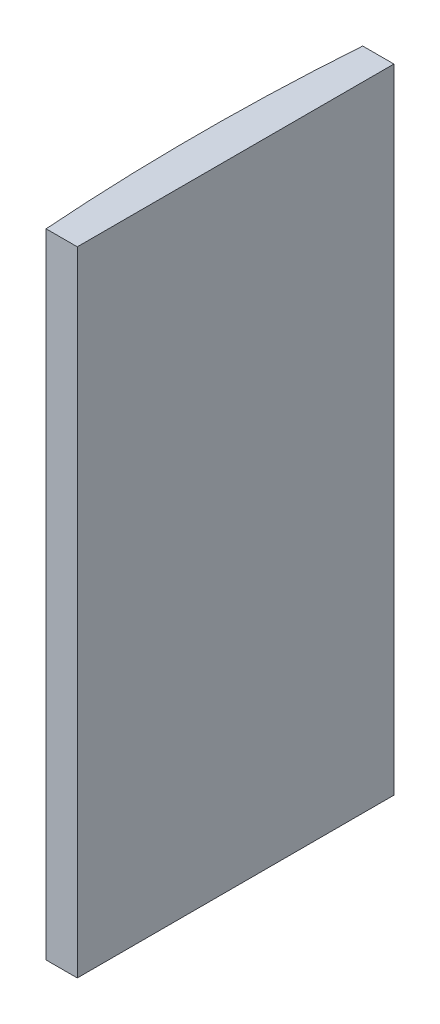
ISO-10303-21;
HEADER;
FILE_DESCRIPTION(('STEP AP214'),'2;1');
FILE_NAME('part.step','',(''),(''),'','','');
FILE_SCHEMA(('AUTOMOTIVE_DESIGN { 1 0 10303 214 1 1 1 1 }'));
ENDSEC;
DATA;
#1=APPLICATION_CONTEXT('core data for automotive mechanical design processes');
#2=APPLICATION_PROTOCOL_DEFINITION('international standard','automotive_design',2000,#1);
#3=PRODUCT_CONTEXT('',#1,'mechanical');
#4=PRODUCT('Part','Part','',(#3));
#5=PRODUCT_RELATED_PRODUCT_CATEGORY('part','',(#4));
#6=PRODUCT_DEFINITION_FORMATION('','',#4);
#7=PRODUCT_DEFINITION_CONTEXT('part definition',#1,'design');
#8=PRODUCT_DEFINITION('design','',#6,#7);
#9=PRODUCT_DEFINITION_SHAPE('','',#8);
#10=(LENGTH_UNIT() NAMED_UNIT(*) SI_UNIT(.MILLI.,.METRE.));
#11=(NAMED_UNIT(*) PLANE_ANGLE_UNIT() SI_UNIT($,.RADIAN.));
#12=(NAMED_UNIT(*) SI_UNIT($,.STERADIAN.) SOLID_ANGLE_UNIT());
#13=UNCERTAINTY_MEASURE_WITH_UNIT(LENGTH_MEASURE(1.E-05),#10,'distance_accuracy_value','');
#14=(GEOMETRIC_REPRESENTATION_CONTEXT(3) GLOBAL_UNCERTAINTY_ASSIGNED_CONTEXT((#13)) GLOBAL_UNIT_ASSIGNED_CONTEXT((#10,
#11,#12)) REPRESENTATION_CONTEXT('',''));
#15=CARTESIAN_POINT('',(0.,0.,0.));
#16=DIRECTION('',(0.,0.,1.));
#17=DIRECTION('',(1.,0.,0.));
#18=AXIS2_PLACEMENT_3D('',#15,#16,#17);
#19=CARTESIAN_POINT('',(4.35520433485127,60.,0.));
#20=DIRECTION('',(0.,-1.,0.));
#21=DIRECTION('',(0.,0.,-1.));
#22=AXIS2_PLACEMENT_3D('',#19,#20,#21);
#23=CYLINDRICAL_SURFACE('',#22,206.8);
#24=CARTESIAN_POINT('',(4.35520433485127,0.,0.));
#25=DIRECTION('',(0.,1.,0.));
#26=DIRECTION('',(0.,0.,1.));
#27=AXIS2_PLACEMENT_3D('',#24,#25,#26);
#28=CIRCLE('',#27,206.8);
#29=CARTESIAN_POINT('',(-201.900074385476,0.,-15.));
#30=VERTEX_POINT('',#29);
#31=CARTESIAN_POINT('',(-201.900074385476,0.,15.));
#32=VERTEX_POINT('',#31);
#33=EDGE_CURVE('E98',#30,#32,#28,.T.);
#34=ORIENTED_EDGE('',*,*,#33,.T.);
#35=DIRECTION('',(0.,-1.,0.));
#36=VECTOR('',#35,1.);
#37=CARTESIAN_POINT('',(-201.900074385476,60.,15.));
#38=LINE('',#37,#36);
#39=CARTESIAN_POINT('',(-201.900074385476,60.,15.));
#40=VERTEX_POINT('',#39);
#41=EDGE_CURVE('E11',#40,#32,#38,.T.);
#42=ORIENTED_EDGE('',*,*,#41,.F.);
#43=CARTESIAN_POINT('',(4.35520433485127,60.,0.));
#44=DIRECTION('',(0.,1.,0.));
#45=DIRECTION('',(0.,0.,1.));
#46=AXIS2_PLACEMENT_3D('',#43,#44,#45);
#47=CIRCLE('',#46,206.8);
#48=CARTESIAN_POINT('',(-201.900074385476,60.,-15.));
#49=VERTEX_POINT('',#48);
#50=EDGE_CURVE('E86',#49,#40,#47,.T.);
#51=ORIENTED_EDGE('',*,*,#50,.F.);
#52=DIRECTION('',(0.,-1.,0.));
#53=VECTOR('',#52,1.);
#54=CARTESIAN_POINT('',(-201.900074385476,60.,-15.));
#55=LINE('',#54,#53);
#56=EDGE_CURVE('E94',#49,#30,#55,.T.);
#57=ORIENTED_EDGE('',*,*,#56,.T.);
#58=EDGE_LOOP('',(#34,#42,#51,#57));
#59=FACE_BOUND('',#58,.T.);
#60=ADVANCED_FACE('F35',(#59),#23,.T.);
#61=CARTESIAN_POINT('',(-201.900074385476,60.,15.));
#62=DIRECTION('',(0.,0.,-1.));
#63=DIRECTION('',(-1.,0.,0.));
#64=AXIS2_PLACEMENT_3D('',#61,#62,#63);
#65=PLANE('',#64);
#66=DIRECTION('',(1.,0.,0.));
#67=VECTOR('',#66,1.);
#68=CARTESIAN_POINT('',(-201.900074385476,0.,15.));
#69=LINE('',#68,#67);
#70=CARTESIAN_POINT('',(-198.944795665149,0.,15.));
#71=VERTEX_POINT('',#70);
#72=EDGE_CURVE('E90',#32,#71,#69,.T.);
#73=ORIENTED_EDGE('',*,*,#72,.T.);
#74=DIRECTION('',(0.,-1.,0.));
#75=VECTOR('',#74,1.);
#76=CARTESIAN_POINT('',(-198.944795665149,60.,15.));
#77=LINE('',#76,#75);
#78=CARTESIAN_POINT('',(-198.944795665149,60.,15.));
#79=VERTEX_POINT('',#78);
#80=EDGE_CURVE('E43',#79,#71,#77,.T.);
#81=ORIENTED_EDGE('',*,*,#80,.F.);
#82=DIRECTION('',(1.,0.,0.));
#83=VECTOR('',#82,1.);
#84=CARTESIAN_POINT('',(-201.900074385476,60.,15.));
#85=LINE('',#84,#83);
#86=EDGE_CURVE('E81',#40,#79,#85,.T.);
#87=ORIENTED_EDGE('',*,*,#86,.F.);
#88=ORIENTED_EDGE('',*,*,#41,.T.);
#89=EDGE_LOOP('',(#73,#81,#87,#88));
#90=FACE_BOUND('',#89,.T.);
#91=ADVANCED_FACE('F89',(#90),#65,.F.);
#92=CARTESIAN_POINT('',(-198.944795665149,60.,-15.));
#93=DIRECTION('',(-1.,0.,0.));
#94=DIRECTION('',(0.,0.,1.));
#95=AXIS2_PLACEMENT_3D('',#92,#93,#94);
#96=PLANE('',#95);
#97=DIRECTION('',(0.,0.,-1.));
#98=VECTOR('',#97,1.);
#99=CARTESIAN_POINT('',(-198.944795665149,0.,-15.));
#100=LINE('',#99,#98);
#101=CARTESIAN_POINT('',(-198.944795665149,0.,-15.));
#102=VERTEX_POINT('',#101);
#103=EDGE_CURVE('E68',#71,#102,#100,.T.);
#104=ORIENTED_EDGE('',*,*,#103,.T.);
#105=DIRECTION('',(0.,-1.,0.));
#106=VECTOR('',#105,1.);
#107=CARTESIAN_POINT('',(-198.944795665149,60.,-15.));
#108=LINE('',#107,#106);
#109=CARTESIAN_POINT('',(-198.944795665149,60.,-15.));
#110=VERTEX_POINT('',#109);
#111=EDGE_CURVE('E91',#110,#102,#108,.T.);
#112=ORIENTED_EDGE('',*,*,#111,.F.);
#113=DIRECTION('',(0.,0.,-1.));
#114=VECTOR('',#113,1.);
#115=CARTESIAN_POINT('',(-198.944795665149,60.,-15.));
#116=LINE('',#115,#114);
#117=EDGE_CURVE('E84',#79,#110,#116,.T.);
#118=ORIENTED_EDGE('',*,*,#117,.F.);
#119=ORIENTED_EDGE('',*,*,#80,.T.);
#120=EDGE_LOOP('',(#104,#112,#118,#119));
#121=FACE_BOUND('',#120,.T.);
#122=ADVANCED_FACE('F92',(#121),#96,.F.);
#123=CARTESIAN_POINT('',(-201.900074385476,60.,-15.));
#124=DIRECTION('',(0.,0.,1.));
#125=DIRECTION('',(1.,0.,0.));
#126=AXIS2_PLACEMENT_3D('',#123,#124,#125);
#127=PLANE('',#126);
#128=DIRECTION('',(-1.,0.,0.));
#129=VECTOR('',#128,1.);
#130=CARTESIAN_POINT('',(-201.900074385476,0.,-15.));
#131=LINE('',#130,#129);
#132=EDGE_CURVE('E74',#102,#30,#131,.T.);
#133=ORIENTED_EDGE('',*,*,#132,.T.);
#134=ORIENTED_EDGE('',*,*,#56,.F.);
#135=DIRECTION('',(-1.,0.,0.));
#136=VECTOR('',#135,1.);
#137=CARTESIAN_POINT('',(-201.900074385476,60.,-15.));
#138=LINE('',#137,#136);
#139=EDGE_CURVE('E51',#110,#49,#138,.T.);
#140=ORIENTED_EDGE('',*,*,#139,.F.);
#141=ORIENTED_EDGE('',*,*,#111,.T.);
#142=EDGE_LOOP('',(#133,#134,#140,#141));
#143=FACE_BOUND('',#142,.T.);
#144=ADVANCED_FACE('F105',(#143),#127,.F.);
#145=CARTESIAN_POINT('',(4.35520433485127,60.,0.));
#146=DIRECTION('',(0.,1.,0.));
#147=DIRECTION('',(0.,0.,1.));
#148=AXIS2_PLACEMENT_3D('',#145,#146,#147);
#149=PLANE('',#148);
#150=ORIENTED_EDGE('',*,*,#50,.T.);
#151=ORIENTED_EDGE('',*,*,#86,.T.);
#152=ORIENTED_EDGE('',*,*,#117,.T.);
#153=ORIENTED_EDGE('',*,*,#139,.T.);
#154=EDGE_LOOP('',(#150,#151,#152,#153));
#155=FACE_BOUND('',#154,.T.);
#156=ADVANCED_FACE('F82',(#155),#149,.T.);
#157=CARTESIAN_POINT('',(4.35520433485127,0.,0.));
#158=DIRECTION('',(0.,1.,0.));
#159=DIRECTION('',(0.,0.,1.));
#160=AXIS2_PLACEMENT_3D('',#157,#158,#159);
#161=PLANE('',#160);
#162=ORIENTED_EDGE('',*,*,#33,.F.);
#163=ORIENTED_EDGE('',*,*,#132,.F.);
#164=ORIENTED_EDGE('',*,*,#103,.F.);
#165=ORIENTED_EDGE('',*,*,#72,.F.);
#166=EDGE_LOOP('',(#162,#163,#164,#165));
#167=FACE_BOUND('',#166,.T.);
#168=ADVANCED_FACE('F108',(#167),#161,.F.);
#169=CLOSED_SHELL('',(#60,#91,#122,#144,#156,#168));
#170=MANIFOLD_SOLID_BREP('B2',#169);
#171=ADVANCED_BREP_SHAPE_REPRESENTATION('',(#18,#170),#14);
#172=SHAPE_DEFINITION_REPRESENTATION(#9,#171);
ENDSEC;
END-ISO-10303-21;
